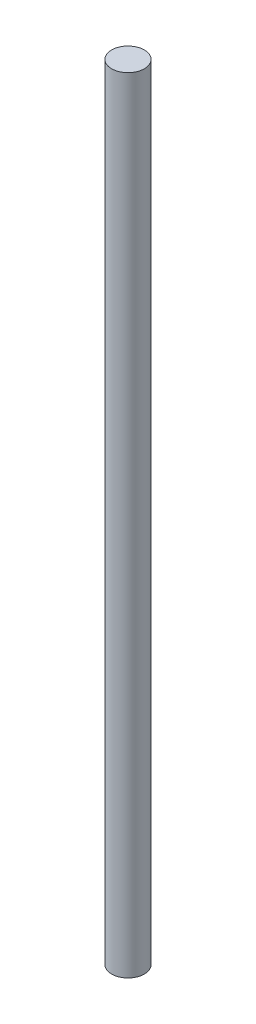
ISO-10303-21;
HEADER;
FILE_DESCRIPTION(('STEP AP214'),'2;1');
FILE_NAME('part.step','',(''),(''),'','','');
FILE_SCHEMA(('AUTOMOTIVE_DESIGN { 1 0 10303 214 1 1 1 1 }'));
ENDSEC;
DATA;
#1=APPLICATION_CONTEXT('core data for automotive mechanical design processes');
#2=APPLICATION_PROTOCOL_DEFINITION('international standard','automotive_design',2000,#1);
#3=PRODUCT_CONTEXT('',#1,'mechanical');
#4=PRODUCT('Part','Part','',(#3));
#5=PRODUCT_RELATED_PRODUCT_CATEGORY('part','',(#4));
#6=PRODUCT_DEFINITION_FORMATION('','',#4);
#7=PRODUCT_DEFINITION_CONTEXT('part definition',#1,'design');
#8=PRODUCT_DEFINITION('design','',#6,#7);
#9=PRODUCT_DEFINITION_SHAPE('','',#8);
#10=(LENGTH_UNIT() NAMED_UNIT(*) SI_UNIT(.MILLI.,.METRE.));
#11=(NAMED_UNIT(*) PLANE_ANGLE_UNIT() SI_UNIT($,.RADIAN.));
#12=(NAMED_UNIT(*) SI_UNIT($,.STERADIAN.) SOLID_ANGLE_UNIT());
#13=UNCERTAINTY_MEASURE_WITH_UNIT(LENGTH_MEASURE(1.E-05),#10,'distance_accuracy_value','');
#14=(GEOMETRIC_REPRESENTATION_CONTEXT(3) GLOBAL_UNCERTAINTY_ASSIGNED_CONTEXT((#13)) GLOBAL_UNIT_ASSIGNED_CONTEXT((#10,
#11,#12)) REPRESENTATION_CONTEXT('',''));
#15=CARTESIAN_POINT('',(0.,0.,0.));
#16=DIRECTION('',(0.,0.,1.));
#17=DIRECTION('',(1.,0.,0.));
#18=AXIS2_PLACEMENT_3D('',#15,#16,#17);
#19=CARTESIAN_POINT('',(0.,76.2,0.));
#20=DIRECTION('',(0.,-1.,0.));
#21=DIRECTION('',(0.,0.,-1.));
#22=AXIS2_PLACEMENT_3D('',#19,#20,#21);
#23=CYLINDRICAL_SURFACE('',#22,1.5875);
#24=CARTESIAN_POINT('',(0.,76.2,0.));
#25=DIRECTION('',(0.,1.,0.));
#26=DIRECTION('',(0.,0.,1.));
#27=AXIS2_PLACEMENT_3D('',#24,#25,#26);
#28=CIRCLE('',#27,1.5875);
#29=CARTESIAN_POINT('',(0.,76.2,1.5875));
#30=VERTEX_POINT('',#29);
#31=EDGE_CURVE('E10',#30,#30,#28,.T.);
#32=ORIENTED_EDGE('',*,*,#31,.F.);
#33=EDGE_LOOP('',(#32));
#34=FACE_BOUND('',#33,.T.);
#35=CARTESIAN_POINT('',(0.,0.,0.));
#36=DIRECTION('',(0.,1.,0.));
#37=DIRECTION('',(0.,0.,1.));
#38=AXIS2_PLACEMENT_3D('',#35,#36,#37);
#39=CIRCLE('',#38,1.5875);
#40=CARTESIAN_POINT('',(0.,0.,1.5875));
#41=VERTEX_POINT('',#40);
#42=EDGE_CURVE('E40',#41,#41,#39,.T.);
#43=ORIENTED_EDGE('',*,*,#42,.T.);
#44=EDGE_LOOP('',(#43));
#45=FACE_BOUND('',#44,.T.);
#46=ADVANCED_FACE('F37',(#34,#45),#23,.T.);
#47=CARTESIAN_POINT('',(0.,76.2,0.));
#48=DIRECTION('',(0.,1.,0.));
#49=DIRECTION('',(0.,0.,1.));
#50=AXIS2_PLACEMENT_3D('',#47,#48,#49);
#51=PLANE('',#50);
#52=ORIENTED_EDGE('',*,*,#31,.T.);
#53=EDGE_LOOP('',(#52));
#54=FACE_BOUND('',#53,.T.);
#55=ADVANCED_FACE('F54',(#54),#51,.T.);
#56=CARTESIAN_POINT('',(0.,0.,0.));
#57=DIRECTION('',(0.,1.,0.));
#58=DIRECTION('',(0.,0.,1.));
#59=AXIS2_PLACEMENT_3D('',#56,#57,#58);
#60=PLANE('',#59);
#61=ORIENTED_EDGE('',*,*,#42,.F.);
#62=EDGE_LOOP('',(#61));
#63=FACE_BOUND('',#62,.T.);
#64=ADVANCED_FACE('F52',(#63),#60,.F.);
#65=CLOSED_SHELL('',(#46,#55,#64));
#66=MANIFOLD_SOLID_BREP('B2',#65);
#67=ADVANCED_BREP_SHAPE_REPRESENTATION('',(#18,#66),#14);
#68=SHAPE_DEFINITION_REPRESENTATION(#9,#67);
ENDSEC;
END-ISO-10303-21;
